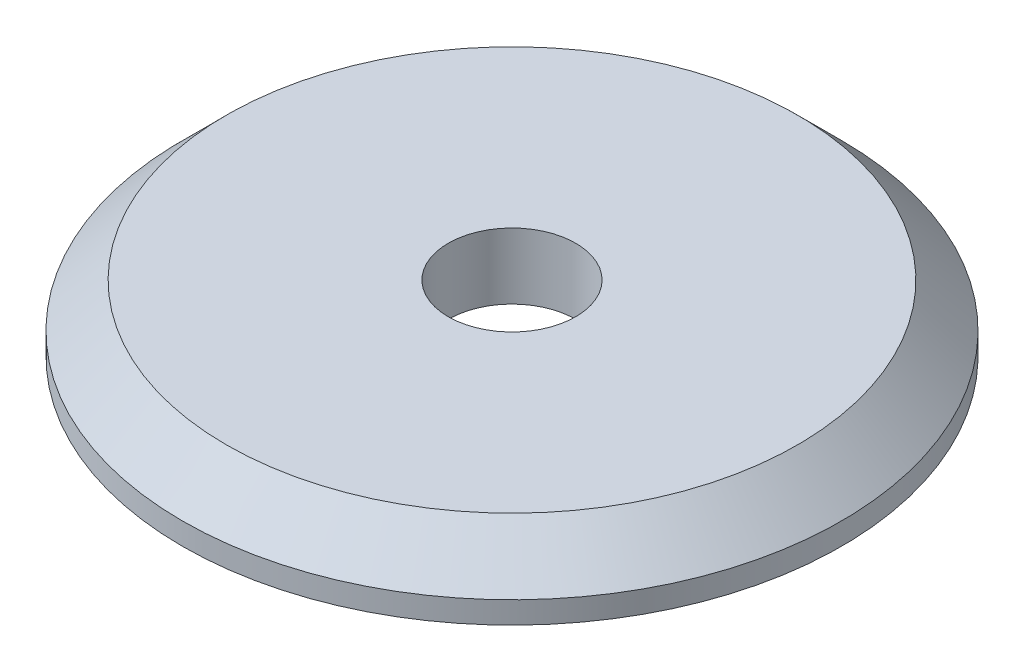
ISO-10303-21;
HEADER;
FILE_DESCRIPTION(('STEP AP214'),'2;1');
FILE_NAME('part.step','',(''),(''),'','','');
FILE_SCHEMA(('AUTOMOTIVE_DESIGN { 1 0 10303 214 1 1 1 1 }'));
ENDSEC;
DATA;
#1=APPLICATION_CONTEXT('core data for automotive mechanical design processes');
#2=APPLICATION_PROTOCOL_DEFINITION('international standard','automotive_design',2000,#1);
#3=PRODUCT_CONTEXT('',#1,'mechanical');
#4=PRODUCT('Part','Part','',(#3));
#5=PRODUCT_RELATED_PRODUCT_CATEGORY('part','',(#4));
#6=PRODUCT_DEFINITION_FORMATION('','',#4);
#7=PRODUCT_DEFINITION_CONTEXT('part definition',#1,'design');
#8=PRODUCT_DEFINITION('design','',#6,#7);
#9=PRODUCT_DEFINITION_SHAPE('','',#8);
#10=(LENGTH_UNIT() NAMED_UNIT(*) SI_UNIT(.MILLI.,.METRE.));
#11=(NAMED_UNIT(*) PLANE_ANGLE_UNIT() SI_UNIT($,.RADIAN.));
#12=(NAMED_UNIT(*) SI_UNIT($,.STERADIAN.) SOLID_ANGLE_UNIT());
#13=UNCERTAINTY_MEASURE_WITH_UNIT(LENGTH_MEASURE(1.E-05),#10,'distance_accuracy_value','');
#14=(GEOMETRIC_REPRESENTATION_CONTEXT(3) GLOBAL_UNCERTAINTY_ASSIGNED_CONTEXT((#13)) GLOBAL_UNIT_ASSIGNED_CONTEXT((#10,
#11,#12)) REPRESENTATION_CONTEXT('',''));
#15=CARTESIAN_POINT('',(0.,0.,0.));
#16=DIRECTION('',(0.,0.,1.));
#17=DIRECTION('',(1.,0.,0.));
#18=AXIS2_PLACEMENT_3D('',#15,#16,#17);
#19=CARTESIAN_POINT('',(0.,3.,0.));
#20=DIRECTION('',(0.,-1.,0.));
#21=DIRECTION('',(0.,0.,-1.));
#22=AXIS2_PLACEMENT_3D('',#19,#20,#21);
#23=CYLINDRICAL_SURFACE('',#22,15.);
#24=CARTESIAN_POINT('',(0.,0.999999999999981,0.));
#25=DIRECTION('',(0.,1.,0.));
#26=DIRECTION('',(0.,0.,1.));
#27=AXIS2_PLACEMENT_3D('',#24,#25,#26);
#28=CIRCLE('',#27,15.);
#29=CARTESIAN_POINT('',(0.,0.999999999999981,15.));
#30=VERTEX_POINT('',#29);
#31=EDGE_CURVE('E10',#30,#30,#28,.F.);
#32=ORIENTED_EDGE('',*,*,#31,.T.);
#33=EDGE_LOOP('',(#32));
#34=FACE_BOUND('',#33,.T.);
#35=CARTESIAN_POINT('',(0.,0.,0.));
#36=DIRECTION('',(0.,1.,0.));
#37=DIRECTION('',(0.,0.,1.));
#38=AXIS2_PLACEMENT_3D('',#35,#36,#37);
#39=CIRCLE('',#38,15.);
#40=CARTESIAN_POINT('',(0.,0.,15.));
#41=VERTEX_POINT('',#40);
#42=EDGE_CURVE('E51',#41,#41,#39,.T.);
#43=ORIENTED_EDGE('',*,*,#42,.T.);
#44=EDGE_LOOP('',(#43));
#45=FACE_BOUND('',#44,.T.);
#46=ADVANCED_FACE('F38',(#34,#45),#23,.T.);
#47=CARTESIAN_POINT('',(0.,3.,0.));
#48=DIRECTION('',(0.,1.,0.));
#49=DIRECTION('',(0.,0.,1.));
#50=AXIS2_PLACEMENT_3D('',#47,#48,#49);
#51=PLANE('',#50);
#52=CARTESIAN_POINT('',(0.,3.,0.));
#53=DIRECTION('',(0.,1.,0.));
#54=DIRECTION('',(0.,0.,1.));
#55=AXIS2_PLACEMENT_3D('',#52,#53,#54);
#56=CIRCLE('',#55,2.9);
#57=CARTESIAN_POINT('',(0.,3.,2.9));
#58=VERTEX_POINT('',#57);
#59=EDGE_CURVE('E56',#58,#58,#56,.T.);
#60=ORIENTED_EDGE('',*,*,#59,.F.);
#61=EDGE_LOOP('',(#60));
#62=FACE_BOUND('',#61,.T.);
#63=CARTESIAN_POINT('',(0.,3.,0.));
#64=DIRECTION('',(0.,1.,0.));
#65=DIRECTION('',(0.,0.,1.));
#66=AXIS2_PLACEMENT_3D('',#63,#64,#65);
#67=CIRCLE('',#66,13.);
#68=CARTESIAN_POINT('',(0.,3.,13.));
#69=VERTEX_POINT('',#68);
#70=EDGE_CURVE('E47',#69,#69,#67,.T.);
#71=ORIENTED_EDGE('',*,*,#70,.T.);
#72=EDGE_LOOP('',(#71));
#73=FACE_BOUND('',#72,.T.);
#74=ADVANCED_FACE('F75',(#62,#73),#51,.T.);
#75=CARTESIAN_POINT('',(0.,0.,0.));
#76=DIRECTION('',(0.,1.,0.));
#77=DIRECTION('',(0.,0.,1.));
#78=AXIS2_PLACEMENT_3D('',#75,#76,#77);
#79=PLANE('',#78);
#80=CARTESIAN_POINT('',(0.,0.,0.));
#81=DIRECTION('',(0.,1.,0.));
#82=DIRECTION('',(0.,0.,1.));
#83=AXIS2_PLACEMENT_3D('',#80,#81,#82);
#84=CIRCLE('',#83,2.9);
#85=CARTESIAN_POINT('',(0.,0.,2.9));
#86=VERTEX_POINT('',#85);
#87=EDGE_CURVE('E43',#86,#86,#84,.T.);
#88=ORIENTED_EDGE('',*,*,#87,.T.);
#89=EDGE_LOOP('',(#88));
#90=FACE_BOUND('',#89,.T.);
#91=ORIENTED_EDGE('',*,*,#42,.F.);
#92=EDGE_LOOP('',(#91));
#93=FACE_BOUND('',#92,.T.);
#94=ADVANCED_FACE('F63',(#90,#93),#79,.F.);
#95=CARTESIAN_POINT('',(0.,3.,0.));
#96=DIRECTION('',(0.,-1.,0.));
#97=DIRECTION('',(0.,0.,-1.));
#98=AXIS2_PLACEMENT_3D('',#95,#96,#97);
#99=CONICAL_SURFACE('',#98,13.,0.785398163397446);
#100=ORIENTED_EDGE('',*,*,#31,.F.);
#101=EDGE_LOOP('',(#100));
#102=FACE_BOUND('',#101,.T.);
#103=ORIENTED_EDGE('',*,*,#70,.F.);
#104=EDGE_LOOP('',(#103));
#105=FACE_BOUND('',#104,.T.);
#106=ADVANCED_FACE('F41',(#102,#105),#99,.T.);
#107=CARTESIAN_POINT('',(0.,3.,0.));
#108=DIRECTION('',(0.,1.,0.));
#109=DIRECTION('',(0.,0.,1.));
#110=AXIS2_PLACEMENT_3D('',#107,#108,#109);
#111=CYLINDRICAL_SURFACE('',#110,2.9);
#112=ORIENTED_EDGE('',*,*,#59,.T.);
#113=EDGE_LOOP('',(#112));
#114=FACE_BOUND('',#113,.T.);
#115=ORIENTED_EDGE('',*,*,#87,.F.);
#116=EDGE_LOOP('',(#115));
#117=FACE_BOUND('',#116,.T.);
#118=ADVANCED_FACE('F66',(#114,#117),#111,.F.);
#119=CLOSED_SHELL('',(#46,#74,#94,#106,#118));
#120=MANIFOLD_SOLID_BREP('B2',#119);
#121=ADVANCED_BREP_SHAPE_REPRESENTATION('',(#18,#120),#14);
#122=SHAPE_DEFINITION_REPRESENTATION(#9,#121);
ENDSEC;
END-ISO-10303-21;
